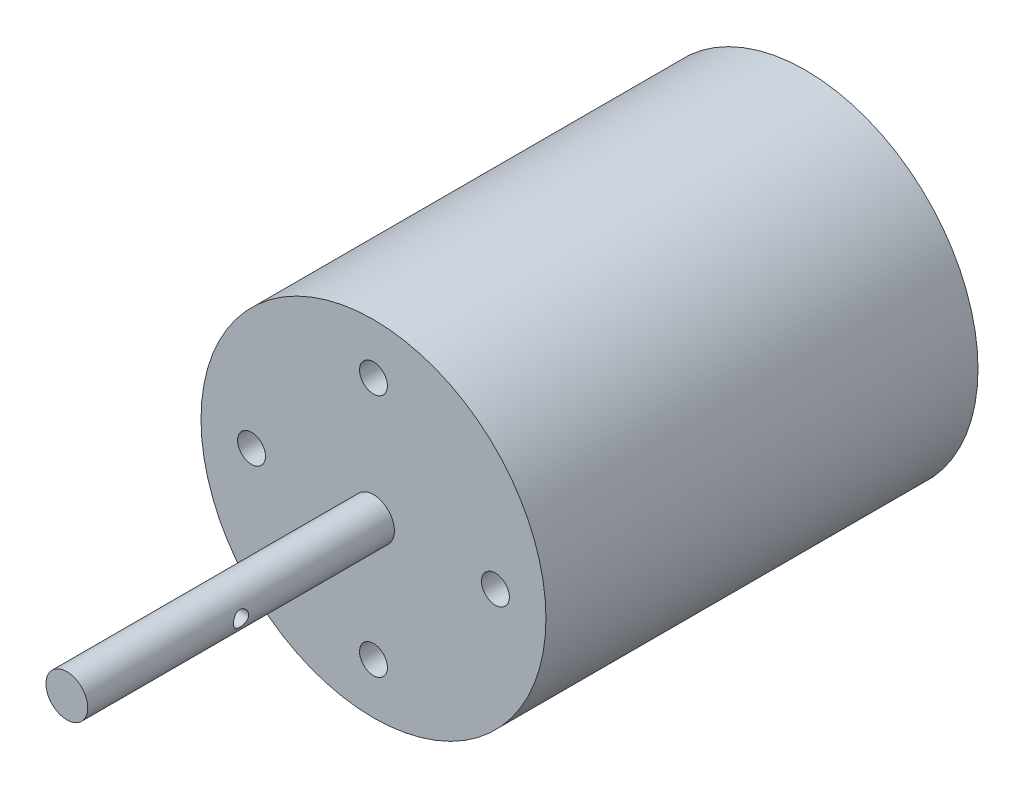
ISO-10303-21;
HEADER;
FILE_DESCRIPTION(('STEP AP214'),'2;1');
FILE_NAME('part.step','',(''),(''),'','','');
FILE_SCHEMA(('AUTOMOTIVE_DESIGN { 1 0 10303 214 1 1 1 1 }'));
ENDSEC;
DATA;
#1=APPLICATION_CONTEXT('core data for automotive mechanical design processes');
#2=APPLICATION_PROTOCOL_DEFINITION('international standard','automotive_design',2000,#1);
#3=PRODUCT_CONTEXT('',#1,'mechanical');
#4=PRODUCT('Part','Part','',(#3));
#5=PRODUCT_RELATED_PRODUCT_CATEGORY('part','',(#4));
#6=PRODUCT_DEFINITION_FORMATION('','',#4);
#7=PRODUCT_DEFINITION_CONTEXT('part definition',#1,'design');
#8=PRODUCT_DEFINITION('design','',#6,#7);
#9=PRODUCT_DEFINITION_SHAPE('','',#8);
#10=(LENGTH_UNIT() NAMED_UNIT(*) SI_UNIT(.MILLI.,.METRE.));
#11=(NAMED_UNIT(*) PLANE_ANGLE_UNIT() SI_UNIT($,.RADIAN.));
#12=(NAMED_UNIT(*) SI_UNIT($,.STERADIAN.) SOLID_ANGLE_UNIT());
#13=UNCERTAINTY_MEASURE_WITH_UNIT(LENGTH_MEASURE(1.E-05),#10,'distance_accuracy_value','');
#14=(GEOMETRIC_REPRESENTATION_CONTEXT(3) GLOBAL_UNCERTAINTY_ASSIGNED_CONTEXT((#13)) GLOBAL_UNIT_ASSIGNED_CONTEXT((#10,
#11,#12)) REPRESENTATION_CONTEXT('',''));
#15=CARTESIAN_POINT('',(0.,0.,0.));
#16=DIRECTION('',(0.,0.,1.));
#17=DIRECTION('',(1.,0.,0.));
#18=AXIS2_PLACEMENT_3D('',#15,#16,#17);
#19=CARTESIAN_POINT('',(0.,0.,-62.));
#20=DIRECTION('',(0.,0.,1.));
#21=DIRECTION('',(1.,0.,0.));
#22=AXIS2_PLACEMENT_3D('',#19,#20,#21);
#23=CYLINDRICAL_SURFACE('',#22,24.75);
#24=CARTESIAN_POINT('',(0.,0.,-62.));
#25=DIRECTION('',(0.,0.,1.));
#26=DIRECTION('',(1.,0.,0.));
#27=AXIS2_PLACEMENT_3D('',#24,#25,#26);
#28=CIRCLE('',#27,24.75);
#29=CARTESIAN_POINT('',(24.75,0.,-62.));
#30=VERTEX_POINT('',#29);
#31=EDGE_CURVE('E50',#30,#30,#28,.T.);
#32=ORIENTED_EDGE('',*,*,#31,.T.);
#33=EDGE_LOOP('',(#32));
#34=FACE_BOUND('',#33,.T.);
#35=CARTESIAN_POINT('',(0.,0.,0.));
#36=DIRECTION('',(0.,0.,1.));
#37=DIRECTION('',(1.,0.,0.));
#38=AXIS2_PLACEMENT_3D('',#35,#36,#37);
#39=CIRCLE('',#38,24.75);
#40=CARTESIAN_POINT('',(24.75,0.,0.));
#41=VERTEX_POINT('',#40);
#42=EDGE_CURVE('E56',#41,#41,#39,.T.);
#43=ORIENTED_EDGE('',*,*,#42,.F.);
#44=EDGE_LOOP('',(#43));
#45=FACE_BOUND('',#44,.T.);
#46=ADVANCED_FACE('F37',(#34,#45),#23,.T.);
#47=CARTESIAN_POINT('',(0.,0.,-62.));
#48=DIRECTION('',(0.,0.,1.));
#49=DIRECTION('',(1.,0.,0.));
#50=AXIS2_PLACEMENT_3D('',#47,#48,#49);
#51=PLANE('',#50);
#52=CARTESIAN_POINT('',(17.5,0.,-62.));
#53=DIRECTION('',(0.,0.,-1.));
#54=DIRECTION('',(-1.,0.,0.));
#55=AXIS2_PLACEMENT_3D('',#52,#53,#54);
#56=CIRCLE('',#55,2.);
#57=CARTESIAN_POINT('',(15.5,0.,-62.));
#58=VERTEX_POINT('',#57);
#59=EDGE_CURVE('E144',#58,#58,#56,.T.);
#60=ORIENTED_EDGE('',*,*,#59,.F.);
#61=EDGE_LOOP('',(#60));
#62=FACE_BOUND('',#61,.T.);
#63=CARTESIAN_POINT('',(-17.5,0.,-62.));
#64=DIRECTION('',(0.,0.,-1.));
#65=DIRECTION('',(-1.,0.,0.));
#66=AXIS2_PLACEMENT_3D('',#63,#64,#65);
#67=CIRCLE('',#66,2.);
#68=CARTESIAN_POINT('',(-19.5,0.,-62.));
#69=VERTEX_POINT('',#68);
#70=EDGE_CURVE('E151',#69,#69,#67,.T.);
#71=ORIENTED_EDGE('',*,*,#70,.F.);
#72=EDGE_LOOP('',(#71));
#73=FACE_BOUND('',#72,.T.);
#74=CARTESIAN_POINT('',(0.,0.,-62.));
#75=DIRECTION('',(0.,0.,-1.));
#76=DIRECTION('',(-1.,0.,0.));
#77=AXIS2_PLACEMENT_3D('',#74,#75,#76);
#78=CIRCLE('',#77,9.);
#79=CARTESIAN_POINT('',(-9.,0.,-62.));
#80=VERTEX_POINT('',#79);
#81=EDGE_CURVE('E10',#80,#80,#78,.T.);
#82=ORIENTED_EDGE('',*,*,#81,.F.);
#83=EDGE_LOOP('',(#82));
#84=FACE_BOUND('',#83,.T.);
#85=ORIENTED_EDGE('',*,*,#31,.F.);
#86=EDGE_LOOP('',(#85));
#87=FACE_BOUND('',#86,.T.);
#88=ADVANCED_FACE('F99',(#62,#73,#84,#87),#51,.F.);
#89=CARTESIAN_POINT('',(0.,0.,0.));
#90=DIRECTION('',(0.,0.,1.));
#91=DIRECTION('',(1.,0.,0.));
#92=AXIS2_PLACEMENT_3D('',#89,#90,#91);
#93=PLANE('',#92);
#94=CARTESIAN_POINT('',(0.,17.5,0.));
#95=DIRECTION('',(0.,0.,1.));
#96=DIRECTION('',(1.,0.,0.));
#97=AXIS2_PLACEMENT_3D('',#94,#95,#96);
#98=CIRCLE('',#97,2.);
#99=CARTESIAN_POINT('',(2.,17.5,0.));
#100=VERTEX_POINT('',#99);
#101=EDGE_CURVE('E116',#100,#100,#98,.T.);
#102=ORIENTED_EDGE('',*,*,#101,.F.);
#103=EDGE_LOOP('',(#102));
#104=FACE_BOUND('',#103,.T.);
#105=CARTESIAN_POINT('',(17.5,0.,0.));
#106=DIRECTION('',(0.,0.,1.));
#107=DIRECTION('',(1.,0.,0.));
#108=AXIS2_PLACEMENT_3D('',#105,#106,#107);
#109=CIRCLE('',#108,2.);
#110=CARTESIAN_POINT('',(19.5,0.,0.));
#111=VERTEX_POINT('',#110);
#112=EDGE_CURVE('E120',#111,#111,#109,.T.);
#113=ORIENTED_EDGE('',*,*,#112,.F.);
#114=EDGE_LOOP('',(#113));
#115=FACE_BOUND('',#114,.T.);
#116=CARTESIAN_POINT('',(0.,-17.5,0.));
#117=DIRECTION('',(0.,0.,1.));
#118=DIRECTION('',(1.,0.,0.));
#119=AXIS2_PLACEMENT_3D('',#116,#117,#118);
#120=CIRCLE('',#119,2.);
#121=CARTESIAN_POINT('',(2.,-17.5,0.));
#122=VERTEX_POINT('',#121);
#123=EDGE_CURVE('E124',#122,#122,#120,.T.);
#124=ORIENTED_EDGE('',*,*,#123,.F.);
#125=EDGE_LOOP('',(#124));
#126=FACE_BOUND('',#125,.T.);
#127=CARTESIAN_POINT('',(-17.5,0.,0.));
#128=DIRECTION('',(0.,0.,1.));
#129=DIRECTION('',(1.,0.,0.));
#130=AXIS2_PLACEMENT_3D('',#127,#128,#129);
#131=CIRCLE('',#130,2.);
#132=CARTESIAN_POINT('',(-15.5,0.,0.));
#133=VERTEX_POINT('',#132);
#134=EDGE_CURVE('E128',#133,#133,#131,.T.);
#135=ORIENTED_EDGE('',*,*,#134,.F.);
#136=EDGE_LOOP('',(#135));
#137=FACE_BOUND('',#136,.T.);
#138=CARTESIAN_POINT('',(0.,0.,0.));
#139=DIRECTION('',(0.,0.,1.));
#140=DIRECTION('',(1.,0.,0.));
#141=AXIS2_PLACEMENT_3D('',#138,#139,#140);
#142=CIRCLE('',#141,3.);
#143=CARTESIAN_POINT('',(3.,0.,0.));
#144=VERTEX_POINT('',#143);
#145=EDGE_CURVE('E66',#144,#144,#142,.T.);
#146=ORIENTED_EDGE('',*,*,#145,.F.);
#147=EDGE_LOOP('',(#146));
#148=FACE_BOUND('',#147,.T.);
#149=ORIENTED_EDGE('',*,*,#42,.T.);
#150=EDGE_LOOP('',(#149));
#151=FACE_BOUND('',#150,.T.);
#152=ADVANCED_FACE('F96',(#104,#115,#126,#137,#148,#151),#93,.T.);
#153=CARTESIAN_POINT('',(0.,0.,44.));
#154=DIRECTION('',(0.,0.,-1.));
#155=DIRECTION('',(-1.,0.,0.));
#156=AXIS2_PLACEMENT_3D('',#153,#154,#155);
#157=CYLINDRICAL_SURFACE('',#156,3.);
#158=CARTESIAN_POINT('',(-3.,0.,23.1));
#159=CARTESIAN_POINT('',(-3.00000124874777,-0.0596653603658475,23.1000016959377));
#160=CARTESIAN_POINT('',(-2.99820433362878,-0.119318861047392,23.0951301942859));
#161=CARTESIAN_POINT('',(-2.99121508676533,-0.236848244255451,23.0758476944229));
#162=CARTESIAN_POINT('',(-2.98602307700504,-0.294724294806991,23.0614376008315));
#163=CARTESIAN_POINT('',(-2.97280239953096,-0.406987138550089,23.0236525816176));
#164=CARTESIAN_POINT('',(-2.96477905699958,-0.461380257103496,23.0002944784406));
#165=CARTESIAN_POINT('',(-2.94669890184719,-0.565473356805778,22.9453600789518));
#166=CARTESIAN_POINT('',(-2.93664157034718,-0.615172135653516,22.9137816850185));
#167=CARTESIAN_POINT('',(-2.91507648167801,-0.710497168894281,22.8419533651427));
#168=CARTESIAN_POINT('',(-2.90352893596448,-0.75590589164363,22.8014267972003));
#169=CARTESIAN_POINT('',(-2.88048533673689,-0.839455790057788,22.7134398983826));
#170=CARTESIAN_POINT('',(-2.86898929891452,-0.877594880931809,22.6659775853424));
#171=CARTESIAN_POINT('',(-2.84689276879725,-0.946876023491568,22.563376148578));
#172=CARTESIAN_POINT('',(-2.83633955824423,-0.977715943844816,22.5080218172978));
#173=CARTESIAN_POINT('',(-2.81793972857027,-1.02955228614908,22.3924637493466));
#174=CARTESIAN_POINT('',(-2.81009208269453,-1.0505524433536,22.3322618630331));
#175=CARTESIAN_POINT('',(-2.798415961319,-1.0812631510737,22.2112164474398));
#176=CARTESIAN_POINT('',(-2.79444077822038,-1.09138742706648,22.1504925023863));
#177=CARTESIAN_POINT('',(-2.7905293041686,-1.10135267987145,22.0280875242816));
#178=CARTESIAN_POINT('',(-2.79059143794103,-1.10119766744092,21.9664068739079));
#179=CARTESIAN_POINT('',(-2.7946206462547,-1.09092609853663,21.8475684309638));
#180=CARTESIAN_POINT('',(-2.79836566494697,-1.08137599754645,21.7903527714323));
#181=CARTESIAN_POINT('',(-2.80897082219962,-1.05351920552002,21.6784010781988));
#182=CARTESIAN_POINT('',(-2.81583140903281,-1.03521125437041,21.6236654025675));
#183=CARTESIAN_POINT('',(-2.8320333504401,-0.990035328733109,21.5170456833763));
#184=CARTESIAN_POINT('',(-2.84141799234525,-0.963016175829747,21.4652325623985));
#185=CARTESIAN_POINT('',(-2.86159544268106,-0.901290064724288,21.3667082597295));
#186=CARTESIAN_POINT('',(-2.87238872140381,-0.866580536276021,21.3199987915719));
#187=CARTESIAN_POINT('',(-2.89501075010137,-0.787840621137831,21.2298618065168));
#188=CARTESIAN_POINT('',(-2.90686155110834,-0.743355730941567,21.1868359200932));
#189=CARTESIAN_POINT('',(-2.92966708861006,-0.647663117597076,21.1087384983429));
#190=CARTESIAN_POINT('',(-2.94062169909304,-0.596454451658583,21.0736680803958));
#191=CARTESIAN_POINT('',(-2.96060161705553,-0.487779773000808,21.0120600315232));
#192=CARTESIAN_POINT('',(-2.96959731294347,-0.430235217521433,20.9856506658485));
#193=CARTESIAN_POINT('',(-2.98442731277654,-0.311108672774423,20.9430190273705));
#194=CARTESIAN_POINT('',(-2.99026295644358,-0.249528406901531,20.9267924370579));
#195=CARTESIAN_POINT('',(-2.99788264484015,-0.127462862761651,20.9057463597197));
#196=CARTESIAN_POINT('',(-2.99985872688891,-0.0670827891130076,20.900385667251));
#197=CARTESIAN_POINT('',(-3.0001264355405,0.0537391869774852,20.8996547992509));
#198=CARTESIAN_POINT('',(-2.99841883675149,0.114181073749808,20.9042825233452));
#199=CARTESIAN_POINT('',(-2.99163788470485,0.231108406159618,20.9229819168092));
#200=CARTESIAN_POINT('',(-2.98668929450055,0.287657784812599,20.9367037311999));
#201=CARTESIAN_POINT('',(-2.97404894323754,0.397615636671328,20.9727460210941));
#202=CARTESIAN_POINT('',(-2.96635682527047,0.451023700166589,20.9950676153823));
#203=CARTESIAN_POINT('',(-2.94871738617956,0.554908427976737,21.0483784353486));
#204=CARTESIAN_POINT('',(-2.93871137811358,0.605255980194477,21.0795992520196));
#205=CARTESIAN_POINT('',(-2.91755723487567,0.700162701835578,21.1495585567129));
#206=CARTESIAN_POINT('',(-2.90640869230438,0.744719793590156,21.188299730741));
#207=CARTESIAN_POINT('',(-2.88343377289124,0.829360890855199,21.274729050306));
#208=CARTESIAN_POINT('',(-2.87160406892303,0.8690601956203,21.322794023905));
#209=CARTESIAN_POINT('',(-2.84920568198054,0.939899669781492,21.4251419979686));
#210=CARTESIAN_POINT('',(-2.83863708661841,0.971039244708763,21.4794254299312));
#211=CARTESIAN_POINT('',(-2.8200170700311,1.02386254843664,21.5930149486137));
#212=CARTESIAN_POINT('',(-2.81197232633534,1.04552125182697,21.6523338404576));
#213=CARTESIAN_POINT('',(-2.79952649364981,1.07840929932519,21.7741515392404));
#214=CARTESIAN_POINT('',(-2.79512328456104,1.08964471233036,21.8366484733941));
#215=CARTESIAN_POINT('',(-2.79073255817453,1.10083806784982,21.9589005440155));
#216=CARTESIAN_POINT('',(-2.79048965654101,1.1014482886697,22.0185873167862));
#217=CARTESIAN_POINT('',(-2.7937971077441,1.09303145247646,22.1371646200869));
#218=CARTESIAN_POINT('',(-2.79734713258729,1.0840052287752,22.1960552190201));
#219=CARTESIAN_POINT('',(-2.80763225279227,1.05707078841707,22.3097076343864));
#220=CARTESIAN_POINT('',(-2.81427578061567,1.03941724094368,22.3645387880301));
#221=CARTESIAN_POINT('',(-2.82994981114228,0.995949426173609,22.4704956611847));
#222=CARTESIAN_POINT('',(-2.83898090407659,0.970133140652863,22.5216204604584));
#223=CARTESIAN_POINT('',(-2.85898260515673,0.909551414968637,22.62153059325));
#224=CARTESIAN_POINT('',(-2.87002834990345,0.874398504847364,22.6700657713279));
#225=CARTESIAN_POINT('',(-2.89254526375225,0.796752399809456,22.7607572977932));
#226=CARTESIAN_POINT('',(-2.90401656412106,0.75425692497287,22.8029116572399));
#227=CARTESIAN_POINT('',(-2.92679216754413,0.660548639786973,22.8818239918814));
#228=CARTESIAN_POINT('',(-2.93805837226636,0.60900261611206,22.9181989614741));
#229=CARTESIAN_POINT('',(-2.95853467976325,0.500136860580023,22.9817509381987));
#230=CARTESIAN_POINT('',(-2.96774477414609,0.44281710515934,23.00892790779));
#231=CARTESIAN_POINT('',(-2.9832468592136,0.322493606369645,23.0536679906505));
#232=CARTESIAN_POINT('',(-2.9894608548018,0.259384186418022,23.0709760902518));
#233=CARTESIAN_POINT('',(-2.99783583601898,0.130844392872352,23.0941386087502));
#234=CARTESIAN_POINT('',(-2.99999863091548,0.0654150686575989,23.0999981406317));
#235=CARTESIAN_POINT('',(-3.,0.,23.1));
#236=B_SPLINE_CURVE_WITH_KNOTS('',3,(#158,#159,#160,#161,#162,#163,#164,#165,#166,#167,#168,
#169,#170,#171,#172,#173,#174,#175,#176,#177,#178,#179,#180,#181,#182,#183,#184,#185,#186,#187,
#188,#189,#190,#191,#192,#193,#194,#195,#196,#197,#198,#199,#200,#201,#202,#203,#204,#205,#206,
#207,#208,#209,#210,#211,#212,#213,#214,#215,#216,#217,#218,#219,#220,#221,#222,#223,#224,#225,
#226,#227,#228,#229,#230,#231,#232,#233,#234,#235),.UNSPECIFIED.,.T.,.F.,(4,2,2,2,2,2,2,2,2,2,2,
2,2,2,2,2,2,2,2,2,2,2,2,2,2,2,2,2,2,2,2,2,2,2,2,2,2,2,4),(0.,0.178754907739739,
0.357492865169349,0.535896427659751,0.714345559175,0.899369895863449,1.08444721440599,
1.27620269157261,1.46788531772088,1.65198550181501,1.83601385439912,2.00958682077848,
2.18318476902303,2.35997410918523,2.53682262453215,2.72499447820699,2.91319274508038,
3.10406398185192,3.29485423420864,3.47588192225445,3.65687154732446,3.83127381950643,
4.00569878814084,4.18515848390998,4.36468239466834,4.55415458027959,4.74363992131372,
4.93362244947295,5.12349429191199,5.3016658147168,5.4798219313811,5.65301061537201,
5.82624215351945,6.00825949460879,6.190333455313,6.38165835431487,6.57298403417707,
6.76905241099166,6.96503320271032),.UNSPECIFIED.);
#237=CARTESIAN_POINT('',(-3.,0.,23.1));
#238=VERTEX_POINT('',#237);
#239=EDGE_CURVE('E40',#238,#238,#236,.T.);
#240=ORIENTED_EDGE('',*,*,#239,.T.);
#241=EDGE_LOOP('',(#240));
#242=FACE_BOUND('',#241,.T.);
#243=CARTESIAN_POINT('',(3.,0.,20.9));
#244=CARTESIAN_POINT('',(3.00000124874777,-0.0596653603658475,20.8999983040623));
#245=CARTESIAN_POINT('',(2.99820433362878,-0.119318861047392,20.9048698057141));
#246=CARTESIAN_POINT('',(2.99121508676533,-0.236848244255451,20.9241523055771));
#247=CARTESIAN_POINT('',(2.98602307700504,-0.294724294806991,20.9385623991685));
#248=CARTESIAN_POINT('',(2.97280239953096,-0.406987138550091,20.9763474183824));
#249=CARTESIAN_POINT('',(2.96477905699958,-0.4613802571035,20.9997055215594));
#250=CARTESIAN_POINT('',(2.94669890184719,-0.565473356805781,21.0546399210482));
#251=CARTESIAN_POINT('',(2.93664157034718,-0.615172135653517,21.0862183149815));
#252=CARTESIAN_POINT('',(2.91507648167801,-0.710497168894281,21.1580466348573));
#253=CARTESIAN_POINT('',(2.90352893596448,-0.755905891643631,21.1985732027997));
#254=CARTESIAN_POINT('',(2.88048533673689,-0.839455790057788,21.2865601016174));
#255=CARTESIAN_POINT('',(2.86898929891452,-0.877594880931808,21.3340224146576));
#256=CARTESIAN_POINT('',(2.84689276879725,-0.946876023491567,21.436623851422));
#257=CARTESIAN_POINT('',(2.83633955824423,-0.977715943844815,21.4919781827022));
#258=CARTESIAN_POINT('',(2.81793972857028,-1.02955228614908,21.6075362506534));
#259=CARTESIAN_POINT('',(2.81009208269453,-1.0505524433536,21.6677381369669));
#260=CARTESIAN_POINT('',(2.798415961319,-1.0812631510737,21.7887835525602));
#261=CARTESIAN_POINT('',(2.79444077822038,-1.09138742706648,21.8495074976137));
#262=CARTESIAN_POINT('',(2.7905293041686,-1.10135267987145,21.9719124757184));
#263=CARTESIAN_POINT('',(2.79059143794103,-1.10119766744092,22.0335931260921));
#264=CARTESIAN_POINT('',(2.7946206462547,-1.09092609853663,22.1524315690362));
#265=CARTESIAN_POINT('',(2.79836566494697,-1.08137599754645,22.2096472285677));
#266=CARTESIAN_POINT('',(2.80897082219962,-1.05351920552002,22.3215989218012));
#267=CARTESIAN_POINT('',(2.81583140903281,-1.03521125437041,22.3763345974325));
#268=CARTESIAN_POINT('',(2.8320333504401,-0.990035328733109,22.4829543166237));
#269=CARTESIAN_POINT('',(2.84141799234525,-0.963016175829747,22.5347674376015));
#270=CARTESIAN_POINT('',(2.86159544268106,-0.901290064724289,22.6332917402705));
#271=CARTESIAN_POINT('',(2.87238872140381,-0.866580536276021,22.6800012084281));
#272=CARTESIAN_POINT('',(2.89501075010137,-0.787840621137831,22.7701381934832));
#273=CARTESIAN_POINT('',(2.90686155110834,-0.743355730941567,22.8131640799068));
#274=CARTESIAN_POINT('',(2.92966708861006,-0.647663117597075,22.8912615016571));
#275=CARTESIAN_POINT('',(2.94062169909304,-0.596454451658583,22.9263319196042));
#276=CARTESIAN_POINT('',(2.96060161705553,-0.487779773000808,22.9879399684768));
#277=CARTESIAN_POINT('',(2.96959731294347,-0.430235217521433,23.0143493341515));
#278=CARTESIAN_POINT('',(2.98442731277654,-0.311108672774423,23.0569809726295));
#279=CARTESIAN_POINT('',(2.99026295644358,-0.249528406901531,23.0732075629421));
#280=CARTESIAN_POINT('',(2.99788264484015,-0.127462862761651,23.0942536402803));
#281=CARTESIAN_POINT('',(2.99985872688891,-0.0670827891130076,23.099614332749));
#282=CARTESIAN_POINT('',(3.0001264355405,0.0537391869774852,23.1003452007491));
#283=CARTESIAN_POINT('',(2.99841883675149,0.114181073749808,23.0957174766548));
#284=CARTESIAN_POINT('',(2.99163788470485,0.231108406159618,23.0770180831908));
#285=CARTESIAN_POINT('',(2.98668929450055,0.287657784812599,23.0632962688001));
#286=CARTESIAN_POINT('',(2.97404894323754,0.397615636671328,23.0272539789059));
#287=CARTESIAN_POINT('',(2.96635682527047,0.451023700166589,23.0049323846177));
#288=CARTESIAN_POINT('',(2.94871738617956,0.554908427976737,22.9516215646514));
#289=CARTESIAN_POINT('',(2.93871137811358,0.605255980194477,22.9204007479804));
#290=CARTESIAN_POINT('',(2.91755723487567,0.700162701835578,22.8504414432871));
#291=CARTESIAN_POINT('',(2.90640869230438,0.744719793590156,22.811700269259));
#292=CARTESIAN_POINT('',(2.88343377289124,0.829360890855199,22.725270949694));
#293=CARTESIAN_POINT('',(2.87160406892303,0.8690601956203,22.677205976095));
#294=CARTESIAN_POINT('',(2.84920568198054,0.939899669781492,22.5748580020314));
#295=CARTESIAN_POINT('',(2.83863708661841,0.971039244708763,22.5205745700688));
#296=CARTESIAN_POINT('',(2.8200170700311,1.02386254843665,22.4069850513863));
#297=CARTESIAN_POINT('',(2.81197232633534,1.04552125182698,22.3476661595424));
#298=CARTESIAN_POINT('',(2.79952649364981,1.07840929932519,22.2258484607596));
#299=CARTESIAN_POINT('',(2.79512328456104,1.08964471233036,22.1633515266059));
#300=CARTESIAN_POINT('',(2.79073255817453,1.10083806784982,22.0410994559845));
#301=CARTESIAN_POINT('',(2.79048965654101,1.1014482886697,21.9814126832138));
#302=CARTESIAN_POINT('',(2.7937971077441,1.09303145247646,21.8628353799131));
#303=CARTESIAN_POINT('',(2.79734713258729,1.0840052287752,21.8039447809799));
#304=CARTESIAN_POINT('',(2.80763225279227,1.05707078841707,21.6902923656136));
#305=CARTESIAN_POINT('',(2.81427578061567,1.03941724094368,21.6354612119699));
#306=CARTESIAN_POINT('',(2.82994981114228,0.995949426173609,21.5295043388153));
#307=CARTESIAN_POINT('',(2.83898090407659,0.970133140652863,21.4783795395416));
#308=CARTESIAN_POINT('',(2.85898260515673,0.909551414968637,21.37846940675));
#309=CARTESIAN_POINT('',(2.87002834990345,0.874398504847364,21.3299342286721));
#310=CARTESIAN_POINT('',(2.89254526375225,0.796752399809456,21.2392427022068));
#311=CARTESIAN_POINT('',(2.90401656412106,0.75425692497287,21.1970883427601));
#312=CARTESIAN_POINT('',(2.92679216754413,0.660548639786973,21.1181760081186));
#313=CARTESIAN_POINT('',(2.93805837226636,0.60900261611206,21.0818010385259));
#314=CARTESIAN_POINT('',(2.95853467976325,0.500136860580023,21.0182490618013));
#315=CARTESIAN_POINT('',(2.96774477414609,0.44281710515934,20.99107209221));
#316=CARTESIAN_POINT('',(2.9832468592136,0.322493606369645,20.9463320093495));
#317=CARTESIAN_POINT('',(2.9894608548018,0.259384186418022,20.9290239097482));
#318=CARTESIAN_POINT('',(2.99783583601898,0.130844392872352,20.9058613912498));
#319=CARTESIAN_POINT('',(2.99999863091548,0.0654150686575989,20.9000018593683));
#320=CARTESIAN_POINT('',(3.,0.,20.9));
#321=B_SPLINE_CURVE_WITH_KNOTS('',3,(#243,#244,#245,#246,#247,#248,#249,#250,#251,#252,#253,
#254,#255,#256,#257,#258,#259,#260,#261,#262,#263,#264,#265,#266,#267,#268,#269,#270,#271,#272,
#273,#274,#275,#276,#277,#278,#279,#280,#281,#282,#283,#284,#285,#286,#287,#288,#289,#290,#291,
#292,#293,#294,#295,#296,#297,#298,#299,#300,#301,#302,#303,#304,#305,#306,#307,#308,#309,#310,
#311,#312,#313,#314,#315,#316,#317,#318,#319,#320),.UNSPECIFIED.,.T.,.F.,(4,2,2,2,2,2,2,2,2,2,2,
2,2,2,2,2,2,2,2,2,2,2,2,2,2,2,2,2,2,2,2,2,2,2,2,2,2,2,4),(0.,0.178754907739739,
0.357492865169349,0.535896427659758,0.714345559175,0.899369895863448,1.08444721440599,
1.27620269157261,1.46788531772088,1.65198550181501,1.83601385439912,2.00958682077848,
2.18318476902303,2.35997410918523,2.53682262453215,2.72499447820699,2.91319274508038,
3.10406398185192,3.29485423420864,3.47588192225445,3.65687154732447,3.83127381950643,
4.00569878814085,4.18515848390998,4.36468239466834,4.55415458027959,4.74363992131372,
4.93362244947296,5.12349429191199,5.3016658147168,5.4798219313811,5.65301061537201,
5.82624215351945,6.00825949460879,6.190333455313,6.38165835431487,6.57298403417707,
6.76905241099166,6.96503320271032),.UNSPECIFIED.);
#322=CARTESIAN_POINT('',(3.,0.,20.9));
#323=VERTEX_POINT('',#322);
#324=EDGE_CURVE('E72',#323,#323,#321,.T.);
#325=ORIENTED_EDGE('',*,*,#324,.T.);
#326=EDGE_LOOP('',(#325));
#327=FACE_BOUND('',#326,.T.);
#328=CARTESIAN_POINT('',(0.,0.,44.));
#329=DIRECTION('',(0.,0.,1.));
#330=DIRECTION('',(1.,0.,0.));
#331=AXIS2_PLACEMENT_3D('',#328,#329,#330);
#332=CIRCLE('',#331,3.);
#333=CARTESIAN_POINT('',(3.,0.,44.));
#334=VERTEX_POINT('',#333);
#335=EDGE_CURVE('E62',#334,#334,#332,.T.);
#336=ORIENTED_EDGE('',*,*,#335,.F.);
#337=EDGE_LOOP('',(#336));
#338=FACE_BOUND('',#337,.T.);
#339=ORIENTED_EDGE('',*,*,#145,.T.);
#340=EDGE_LOOP('',(#339));
#341=FACE_BOUND('',#340,.T.);
#342=ADVANCED_FACE('F78',(#242,#327,#338,#341),#157,.T.);
#343=CARTESIAN_POINT('',(0.,0.,44.));
#344=DIRECTION('',(0.,0.,1.));
#345=DIRECTION('',(1.,0.,0.));
#346=AXIS2_PLACEMENT_3D('',#343,#344,#345);
#347=PLANE('',#346);
#348=ORIENTED_EDGE('',*,*,#335,.T.);
#349=EDGE_LOOP('',(#348));
#350=FACE_BOUND('',#349,.T.);
#351=ADVANCED_FACE('F87',(#350),#347,.T.);
#352=CARTESIAN_POINT('',(-24.75,0.,22.));
#353=DIRECTION('',(1.,0.,0.));
#354=DIRECTION('',(0.,0.,-1.));
#355=AXIS2_PLACEMENT_3D('',#352,#353,#354);
#356=CYLINDRICAL_SURFACE('',#355,1.1);
#357=ORIENTED_EDGE('',*,*,#324,.F.);
#358=EDGE_LOOP('',(#357));
#359=FACE_BOUND('',#358,.T.);
#360=ORIENTED_EDGE('',*,*,#239,.F.);
#361=EDGE_LOOP('',(#360));
#362=FACE_BOUND('',#361,.T.);
#363=ADVANCED_FACE('F82',(#359,#362),#356,.F.);
#364=CARTESIAN_POINT('',(0.,0.,-69.));
#365=DIRECTION('',(0.,0.,1.));
#366=DIRECTION('',(1.,0.,0.));
#367=AXIS2_PLACEMENT_3D('',#364,#365,#366);
#368=CYLINDRICAL_SURFACE('',#367,9.);
#369=CARTESIAN_POINT('',(0.,0.,-69.));
#370=DIRECTION('',(0.,0.,-1.));
#371=DIRECTION('',(-1.,0.,0.));
#372=AXIS2_PLACEMENT_3D('',#369,#370,#371);
#373=CIRCLE('',#372,9.);
#374=CARTESIAN_POINT('',(-9.,0.,-69.));
#375=VERTEX_POINT('',#374);
#376=EDGE_CURVE('E60',#375,#375,#373,.T.);
#377=ORIENTED_EDGE('',*,*,#376,.F.);
#378=EDGE_LOOP('',(#377));
#379=FACE_BOUND('',#378,.T.);
#380=ORIENTED_EDGE('',*,*,#81,.T.);
#381=EDGE_LOOP('',(#380));
#382=FACE_BOUND('',#381,.T.);
#383=ADVANCED_FACE('F86',(#379,#382),#368,.T.);
#384=CARTESIAN_POINT('',(0.,0.,-69.));
#385=DIRECTION('',(0.,0.,-1.));
#386=DIRECTION('',(-1.,0.,0.));
#387=AXIS2_PLACEMENT_3D('',#384,#385,#386);
#388=PLANE('',#387);
#389=ORIENTED_EDGE('',*,*,#376,.T.);
#390=EDGE_LOOP('',(#389));
#391=FACE_BOUND('',#390,.T.);
#392=ADVANCED_FACE('F212',(#391),#388,.T.);
#393=CARTESIAN_POINT('',(-17.5,0.,-52.));
#394=DIRECTION('',(0.,0.,-1.));
#395=DIRECTION('',(-1.,0.,0.));
#396=AXIS2_PLACEMENT_3D('',#393,#394,#395);
#397=CYLINDRICAL_SURFACE('',#396,2.);
#398=CARTESIAN_POINT('',(-17.5,0.,-52.));
#399=DIRECTION('',(0.,0.,-1.));
#400=DIRECTION('',(-1.,0.,0.));
#401=AXIS2_PLACEMENT_3D('',#398,#399,#400);
#402=CIRCLE('',#401,2.);
#403=CARTESIAN_POINT('',(-19.5,0.,-52.));
#404=VERTEX_POINT('',#403);
#405=EDGE_CURVE('E148',#404,#404,#402,.T.);
#406=ORIENTED_EDGE('',*,*,#405,.F.);
#407=EDGE_LOOP('',(#406));
#408=FACE_BOUND('',#407,.T.);
#409=ORIENTED_EDGE('',*,*,#70,.T.);
#410=EDGE_LOOP('',(#409));
#411=FACE_BOUND('',#410,.T.);
#412=ADVANCED_FACE('F209',(#408,#411),#397,.F.);
#413=CARTESIAN_POINT('',(-17.5,0.,-52.));
#414=DIRECTION('',(0.,0.,-1.));
#415=DIRECTION('',(-1.,0.,0.));
#416=AXIS2_PLACEMENT_3D('',#413,#414,#415);
#417=PLANE('',#416);
#418=ORIENTED_EDGE('',*,*,#405,.T.);
#419=EDGE_LOOP('',(#418));
#420=FACE_BOUND('',#419,.T.);
#421=ADVANCED_FACE('F205',(#420),#417,.T.);
#422=CARTESIAN_POINT('',(17.5,0.,-52.));
#423=DIRECTION('',(0.,0.,-1.));
#424=DIRECTION('',(-1.,0.,0.));
#425=AXIS2_PLACEMENT_3D('',#422,#423,#424);
#426=CYLINDRICAL_SURFACE('',#425,2.);
#427=CARTESIAN_POINT('',(17.5,0.,-52.));
#428=DIRECTION('',(0.,0.,-1.));
#429=DIRECTION('',(-1.,0.,0.));
#430=AXIS2_PLACEMENT_3D('',#427,#428,#429);
#431=CIRCLE('',#430,2.);
#432=CARTESIAN_POINT('',(15.5,0.,-52.));
#433=VERTEX_POINT('',#432);
#434=EDGE_CURVE('E140',#433,#433,#431,.T.);
#435=ORIENTED_EDGE('',*,*,#434,.F.);
#436=EDGE_LOOP('',(#435));
#437=FACE_BOUND('',#436,.T.);
#438=ORIENTED_EDGE('',*,*,#59,.T.);
#439=EDGE_LOOP('',(#438));
#440=FACE_BOUND('',#439,.T.);
#441=ADVANCED_FACE('F201',(#437,#440),#426,.F.);
#442=CARTESIAN_POINT('',(17.5,0.,-52.));
#443=DIRECTION('',(0.,0.,-1.));
#444=DIRECTION('',(-1.,0.,0.));
#445=AXIS2_PLACEMENT_3D('',#442,#443,#444);
#446=PLANE('',#445);
#447=ORIENTED_EDGE('',*,*,#434,.T.);
#448=EDGE_LOOP('',(#447));
#449=FACE_BOUND('',#448,.T.);
#450=ADVANCED_FACE('F197',(#449),#446,.T.);
#451=CARTESIAN_POINT('',(-17.5,0.,-5.));
#452=DIRECTION('',(0.,0.,1.));
#453=DIRECTION('',(1.,0.,0.));
#454=AXIS2_PLACEMENT_3D('',#451,#452,#453);
#455=CYLINDRICAL_SURFACE('',#454,2.);
#456=CARTESIAN_POINT('',(-17.5,0.,-5.));
#457=DIRECTION('',(0.,0.,1.));
#458=DIRECTION('',(1.,0.,0.));
#459=AXIS2_PLACEMENT_3D('',#456,#457,#458);
#460=CIRCLE('',#459,2.);
#461=CARTESIAN_POINT('',(-15.5,0.,-5.));
#462=VERTEX_POINT('',#461);
#463=EDGE_CURVE('E133',#462,#462,#460,.T.);
#464=ORIENTED_EDGE('',*,*,#463,.F.);
#465=EDGE_LOOP('',(#464));
#466=FACE_BOUND('',#465,.T.);
#467=ORIENTED_EDGE('',*,*,#134,.T.);
#468=EDGE_LOOP('',(#467));
#469=FACE_BOUND('',#468,.T.);
#470=ADVANCED_FACE('F189',(#466,#469),#455,.F.);
#471=CARTESIAN_POINT('',(-17.5,0.,-5.));
#472=DIRECTION('',(0.,0.,1.));
#473=DIRECTION('',(1.,0.,0.));
#474=AXIS2_PLACEMENT_3D('',#471,#472,#473);
#475=PLANE('',#474);
#476=ORIENTED_EDGE('',*,*,#463,.T.);
#477=EDGE_LOOP('',(#476));
#478=FACE_BOUND('',#477,.T.);
#479=ADVANCED_FACE('F179',(#478),#475,.T.);
#480=CARTESIAN_POINT('',(0.,-17.5,-5.));
#481=DIRECTION('',(0.,0.,1.));
#482=DIRECTION('',(1.,0.,0.));
#483=AXIS2_PLACEMENT_3D('',#480,#481,#482);
#484=CYLINDRICAL_SURFACE('',#483,2.);
#485=CARTESIAN_POINT('',(0.,-17.5,-5.));
#486=DIRECTION('',(0.,0.,1.));
#487=DIRECTION('',(1.,0.,0.));
#488=AXIS2_PLACEMENT_3D('',#485,#486,#487);
#489=CIRCLE('',#488,2.);
#490=CARTESIAN_POINT('',(2.,-17.5,-5.));
#491=VERTEX_POINT('',#490);
#492=EDGE_CURVE('E171',#491,#491,#489,.T.);
#493=ORIENTED_EDGE('',*,*,#492,.F.);
#494=EDGE_LOOP('',(#493));
#495=FACE_BOUND('',#494,.T.);
#496=ORIENTED_EDGE('',*,*,#123,.T.);
#497=EDGE_LOOP('',(#496));
#498=FACE_BOUND('',#497,.T.);
#499=ADVANCED_FACE('F176',(#495,#498),#484,.F.);
#500=CARTESIAN_POINT('',(0.,-17.5,-5.));
#501=DIRECTION('',(0.,0.,1.));
#502=DIRECTION('',(1.,0.,0.));
#503=AXIS2_PLACEMENT_3D('',#500,#501,#502);
#504=PLANE('',#503);
#505=ORIENTED_EDGE('',*,*,#492,.T.);
#506=EDGE_LOOP('',(#505));
#507=FACE_BOUND('',#506,.T.);
#508=ADVANCED_FACE('F178',(#507),#504,.T.);
#509=CARTESIAN_POINT('',(17.5,0.,-5.));
#510=DIRECTION('',(0.,0.,1.));
#511=DIRECTION('',(1.,0.,0.));
#512=AXIS2_PLACEMENT_3D('',#509,#510,#511);
#513=CYLINDRICAL_SURFACE('',#512,2.);
#514=CARTESIAN_POINT('',(17.5,0.,-5.));
#515=DIRECTION('',(0.,0.,1.));
#516=DIRECTION('',(1.,0.,0.));
#517=AXIS2_PLACEMENT_3D('',#514,#515,#516);
#518=CIRCLE('',#517,2.);
#519=CARTESIAN_POINT('',(19.5,0.,-5.));
#520=VERTEX_POINT('',#519);
#521=EDGE_CURVE('E163',#520,#520,#518,.T.);
#522=ORIENTED_EDGE('',*,*,#521,.F.);
#523=EDGE_LOOP('',(#522));
#524=FACE_BOUND('',#523,.T.);
#525=ORIENTED_EDGE('',*,*,#112,.T.);
#526=EDGE_LOOP('',(#525));
#527=FACE_BOUND('',#526,.T.);
#528=ADVANCED_FACE('F186',(#524,#527),#513,.F.);
#529=CARTESIAN_POINT('',(17.5,0.,-5.));
#530=DIRECTION('',(0.,0.,1.));
#531=DIRECTION('',(1.,0.,0.));
#532=AXIS2_PLACEMENT_3D('',#529,#530,#531);
#533=PLANE('',#532);
#534=ORIENTED_EDGE('',*,*,#521,.T.);
#535=EDGE_LOOP('',(#534));
#536=FACE_BOUND('',#535,.T.);
#537=ADVANCED_FACE('F296',(#536),#533,.T.);
#538=CARTESIAN_POINT('',(0.,17.5,-5.));
#539=DIRECTION('',(0.,0.,1.));
#540=DIRECTION('',(1.,0.,0.));
#541=AXIS2_PLACEMENT_3D('',#538,#539,#540);
#542=CYLINDRICAL_SURFACE('',#541,2.);
#543=CARTESIAN_POINT('',(0.,17.5,-5.));
#544=DIRECTION('',(0.,0.,1.));
#545=DIRECTION('',(1.,0.,0.));
#546=AXIS2_PLACEMENT_3D('',#543,#544,#545);
#547=CIRCLE('',#546,2.);
#548=CARTESIAN_POINT('',(2.,17.5,-5.));
#549=VERTEX_POINT('',#548);
#550=EDGE_CURVE('E154',#549,#549,#547,.T.);
#551=ORIENTED_EDGE('',*,*,#550,.F.);
#552=EDGE_LOOP('',(#551));
#553=FACE_BOUND('',#552,.T.);
#554=ORIENTED_EDGE('',*,*,#101,.T.);
#555=EDGE_LOOP('',(#554));
#556=FACE_BOUND('',#555,.T.);
#557=ADVANCED_FACE('F305',(#553,#556),#542,.F.);
#558=CARTESIAN_POINT('',(0.,17.5,-5.));
#559=DIRECTION('',(0.,0.,1.));
#560=DIRECTION('',(1.,0.,0.));
#561=AXIS2_PLACEMENT_3D('',#558,#559,#560);
#562=PLANE('',#561);
#563=ORIENTED_EDGE('',*,*,#550,.T.);
#564=EDGE_LOOP('',(#563));
#565=FACE_BOUND('',#564,.T.);
#566=ADVANCED_FACE('F315',(#565),#562,.T.);
#567=CLOSED_SHELL('',(#46,#88,#152,#342,#351,#363,#383,#392,#412,#421,#441,#450,#470,#479,#499,
#508,#528,#537,#557,#566));
#568=MANIFOLD_SOLID_BREP('B2',#567);
#569=ADVANCED_BREP_SHAPE_REPRESENTATION('',(#18,#568),#14);
#570=SHAPE_DEFINITION_REPRESENTATION(#9,#569);
ENDSEC;
END-ISO-10303-21;
